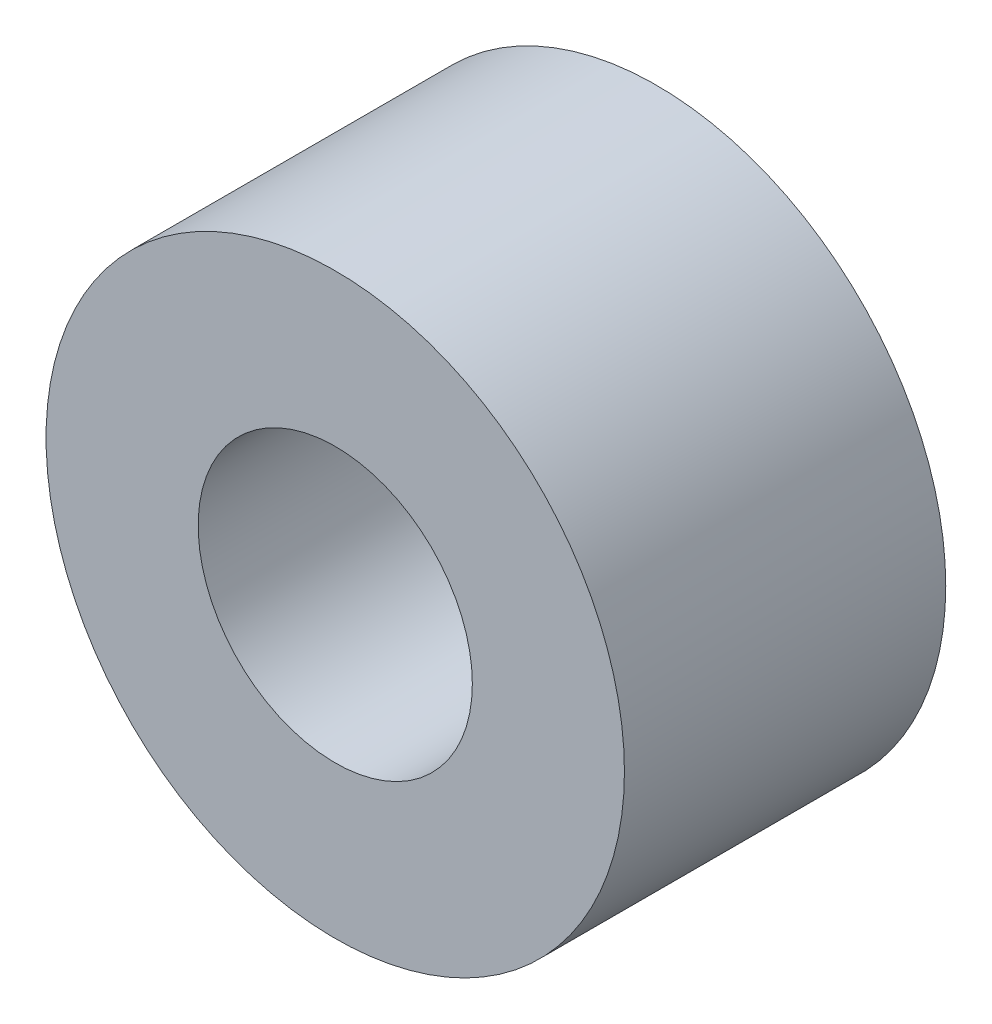
ISO-10303-21;
HEADER;
FILE_DESCRIPTION(('STEP AP214'),'2;1');
FILE_NAME('part.step','',(''),(''),'','','');
FILE_SCHEMA(('AUTOMOTIVE_DESIGN { 1 0 10303 214 1 1 1 1 }'));
ENDSEC;
DATA;
#1=APPLICATION_CONTEXT('core data for automotive mechanical design processes');
#2=APPLICATION_PROTOCOL_DEFINITION('international standard','automotive_design',2000,#1);
#3=PRODUCT_CONTEXT('',#1,'mechanical');
#4=PRODUCT('Part','Part','',(#3));
#5=PRODUCT_RELATED_PRODUCT_CATEGORY('part','',(#4));
#6=PRODUCT_DEFINITION_FORMATION('','',#4);
#7=PRODUCT_DEFINITION_CONTEXT('part definition',#1,'design');
#8=PRODUCT_DEFINITION('design','',#6,#7);
#9=PRODUCT_DEFINITION_SHAPE('','',#8);
#10=(LENGTH_UNIT() NAMED_UNIT(*) SI_UNIT(.MILLI.,.METRE.));
#11=(NAMED_UNIT(*) PLANE_ANGLE_UNIT() SI_UNIT($,.RADIAN.));
#12=(NAMED_UNIT(*) SI_UNIT($,.STERADIAN.) SOLID_ANGLE_UNIT());
#13=UNCERTAINTY_MEASURE_WITH_UNIT(LENGTH_MEASURE(1.E-05),#10,'distance_accuracy_value','');
#14=(GEOMETRIC_REPRESENTATION_CONTEXT(3) GLOBAL_UNCERTAINTY_ASSIGNED_CONTEXT((#13)) GLOBAL_UNIT_ASSIGNED_CONTEXT((#10,
#11,#12)) REPRESENTATION_CONTEXT('',''));
#15=CARTESIAN_POINT('',(0.,0.,0.));
#16=DIRECTION('',(0.,0.,1.));
#17=DIRECTION('',(1.,0.,0.));
#18=AXIS2_PLACEMENT_3D('',#15,#16,#17);
#19=CARTESIAN_POINT('',(0.,0.,5.));
#20=DIRECTION('',(0.,0.,1.));
#21=DIRECTION('',(1.,0.,0.));
#22=AXIS2_PLACEMENT_3D('',#19,#20,#21);
#23=PLANE('',#22);
#24=CARTESIAN_POINT('',(0.,0.,5.));
#25=DIRECTION('',(0.,0.,1.));
#26=DIRECTION('',(1.,0.,0.));
#27=AXIS2_PLACEMENT_3D('',#24,#25,#26);
#28=CIRCLE('',#27,4.5);
#29=CARTESIAN_POINT('',(4.5,0.,5.));
#30=VERTEX_POINT('',#29);
#31=EDGE_CURVE('E10',#30,#30,#28,.T.);
#32=ORIENTED_EDGE('',*,*,#31,.T.);
#33=EDGE_LOOP('',(#32));
#34=FACE_BOUND('',#33,.T.);
#35=CARTESIAN_POINT('',(0.,0.,5.));
#36=DIRECTION('',(0.,0.,1.));
#37=DIRECTION('',(1.,0.,0.));
#38=AXIS2_PLACEMENT_3D('',#35,#36,#37);
#39=CIRCLE('',#38,2.13333333333333);
#40=CARTESIAN_POINT('',(2.13333333333333,0.,5.));
#41=VERTEX_POINT('',#40);
#42=EDGE_CURVE('E47',#41,#41,#39,.T.);
#43=ORIENTED_EDGE('',*,*,#42,.F.);
#44=EDGE_LOOP('',(#43));
#45=FACE_BOUND('',#44,.T.);
#46=ADVANCED_FACE('F36',(#34,#45),#23,.T.);
#47=CARTESIAN_POINT('',(0.,0.,0.));
#48=DIRECTION('',(0.,0.,1.));
#49=DIRECTION('',(1.,0.,0.));
#50=AXIS2_PLACEMENT_3D('',#47,#48,#49);
#51=PLANE('',#50);
#52=CARTESIAN_POINT('',(0.,0.,0.));
#53=DIRECTION('',(0.,0.,1.));
#54=DIRECTION('',(1.,0.,0.));
#55=AXIS2_PLACEMENT_3D('',#52,#53,#54);
#56=CIRCLE('',#55,4.5);
#57=CARTESIAN_POINT('',(4.5,0.,0.));
#58=VERTEX_POINT('',#57);
#59=EDGE_CURVE('E40',#58,#58,#56,.T.);
#60=ORIENTED_EDGE('',*,*,#59,.F.);
#61=EDGE_LOOP('',(#60));
#62=FACE_BOUND('',#61,.T.);
#63=CARTESIAN_POINT('',(0.,0.,0.));
#64=DIRECTION('',(0.,0.,1.));
#65=DIRECTION('',(1.,0.,0.));
#66=AXIS2_PLACEMENT_3D('',#63,#64,#65);
#67=CIRCLE('',#66,2.13333333333333);
#68=CARTESIAN_POINT('',(2.13333333333333,0.,0.));
#69=VERTEX_POINT('',#68);
#70=EDGE_CURVE('E49',#69,#69,#67,.T.);
#71=ORIENTED_EDGE('',*,*,#70,.T.);
#72=EDGE_LOOP('',(#71));
#73=FACE_BOUND('',#72,.T.);
#74=ADVANCED_FACE('F59',(#62,#73),#51,.F.);
#75=CARTESIAN_POINT('',(0.,0.,5.));
#76=DIRECTION('',(0.,0.,-1.));
#77=DIRECTION('',(-1.,0.,0.));
#78=AXIS2_PLACEMENT_3D('',#75,#76,#77);
#79=CYLINDRICAL_SURFACE('',#78,4.5);
#80=ORIENTED_EDGE('',*,*,#31,.F.);
#81=EDGE_LOOP('',(#80));
#82=FACE_BOUND('',#81,.T.);
#83=ORIENTED_EDGE('',*,*,#59,.T.);
#84=EDGE_LOOP('',(#83));
#85=FACE_BOUND('',#84,.T.);
#86=ADVANCED_FACE('F38',(#82,#85),#79,.T.);
#87=CARTESIAN_POINT('',(0.,0.,5.));
#88=DIRECTION('',(0.,0.,-1.));
#89=DIRECTION('',(-1.,0.,0.));
#90=AXIS2_PLACEMENT_3D('',#87,#88,#89);
#91=CYLINDRICAL_SURFACE('',#90,2.13333333333333);
#92=ORIENTED_EDGE('',*,*,#42,.T.);
#93=EDGE_LOOP('',(#92));
#94=FACE_BOUND('',#93,.T.);
#95=ORIENTED_EDGE('',*,*,#70,.F.);
#96=EDGE_LOOP('',(#95));
#97=FACE_BOUND('',#96,.T.);
#98=ADVANCED_FACE('F55',(#94,#97),#91,.F.);
#99=CLOSED_SHELL('',(#46,#74,#86,#98));
#100=MANIFOLD_SOLID_BREP('B2',#99);
#101=ADVANCED_BREP_SHAPE_REPRESENTATION('',(#18,#100),#14);
#102=SHAPE_DEFINITION_REPRESENTATION(#9,#101);
ENDSEC;
END-ISO-10303-21;
